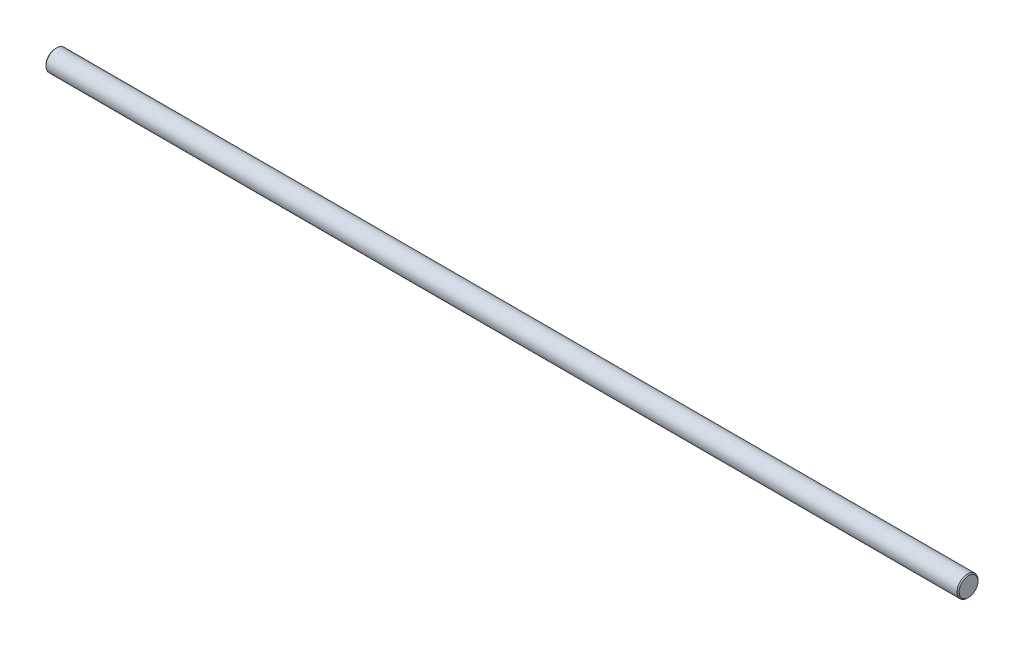
ISO-10303-21;
HEADER;
FILE_DESCRIPTION(('STEP AP214'),'2;1');
FILE_NAME('part.step','',(''),(''),'','','');
FILE_SCHEMA(('AUTOMOTIVE_DESIGN { 1 0 10303 214 1 1 1 1 }'));
ENDSEC;
DATA;
#1=APPLICATION_CONTEXT('core data for automotive mechanical design processes');
#2=APPLICATION_PROTOCOL_DEFINITION('international standard','automotive_design',2000,#1);
#3=PRODUCT_CONTEXT('',#1,'mechanical');
#4=PRODUCT('Part','Part','',(#3));
#5=PRODUCT_RELATED_PRODUCT_CATEGORY('part','',(#4));
#6=PRODUCT_DEFINITION_FORMATION('','',#4);
#7=PRODUCT_DEFINITION_CONTEXT('part definition',#1,'design');
#8=PRODUCT_DEFINITION('design','',#6,#7);
#9=PRODUCT_DEFINITION_SHAPE('','',#8);
#10=(LENGTH_UNIT() NAMED_UNIT(*) SI_UNIT(.MILLI.,.METRE.));
#11=(NAMED_UNIT(*) PLANE_ANGLE_UNIT() SI_UNIT($,.RADIAN.));
#12=(NAMED_UNIT(*) SI_UNIT($,.STERADIAN.) SOLID_ANGLE_UNIT());
#13=UNCERTAINTY_MEASURE_WITH_UNIT(LENGTH_MEASURE(1.E-05),#10,'distance_accuracy_value','');
#14=(GEOMETRIC_REPRESENTATION_CONTEXT(3) GLOBAL_UNCERTAINTY_ASSIGNED_CONTEXT((#13)) GLOBAL_UNIT_ASSIGNED_CONTEXT((#10,
#11,#12)) REPRESENTATION_CONTEXT('',''));
#15=CARTESIAN_POINT('',(0.,0.,0.));
#16=DIRECTION('',(0.,0.,1.));
#17=DIRECTION('',(1.,0.,0.));
#18=AXIS2_PLACEMENT_3D('',#15,#16,#17);
#19=CARTESIAN_POINT('',(0.,0.,0.));
#20=DIRECTION('',(1.,0.,0.));
#21=DIRECTION('',(0.,1.,0.));
#22=AXIS2_PLACEMENT_3D('',#19,#20,#21);
#23=PLANE('',#22);
#24=CARTESIAN_POINT('',(0.,0.,0.));
#25=DIRECTION('',(-1.,0.,0.));
#26=DIRECTION('',(0.,-1.,0.));
#27=AXIS2_PLACEMENT_3D('',#24,#25,#26);
#28=CIRCLE('',#27,4.5);
#29=CARTESIAN_POINT('',(0.,-4.5,0.));
#30=VERTEX_POINT('',#29);
#31=EDGE_CURVE('E10',#30,#30,#28,.T.);
#32=ORIENTED_EDGE('',*,*,#31,.T.);
#33=EDGE_LOOP('',(#32));
#34=FACE_BOUND('',#33,.T.);
#35=ADVANCED_FACE('F31',(#34),#23,.F.);
#36=CARTESIAN_POINT('',(0.5,0.,0.));
#37=DIRECTION('',(1.,0.,0.));
#38=DIRECTION('',(0.,1.,0.));
#39=AXIS2_PLACEMENT_3D('',#36,#37,#38);
#40=CONICAL_SURFACE('',#39,5.,0.785398163397448);
#41=ORIENTED_EDGE('',*,*,#31,.F.);
#42=EDGE_LOOP('',(#41));
#43=FACE_BOUND('',#42,.T.);
#44=CARTESIAN_POINT('',(0.5,0.,0.));
#45=DIRECTION('',(-1.,0.,0.));
#46=DIRECTION('',(0.,-1.,0.));
#47=AXIS2_PLACEMENT_3D('',#44,#45,#46);
#48=CIRCLE('',#47,5.);
#49=CARTESIAN_POINT('',(0.500000000000001,-5.,0.));
#50=VERTEX_POINT('',#49);
#51=EDGE_CURVE('E37',#50,#50,#48,.T.);
#52=ORIENTED_EDGE('',*,*,#51,.T.);
#53=EDGE_LOOP('',(#52));
#54=FACE_BOUND('',#53,.T.);
#55=ADVANCED_FACE('F63',(#43,#54),#40,.T.);
#56=CARTESIAN_POINT('',(435.,0.,0.));
#57=DIRECTION('',(-1.,0.,0.));
#58=DIRECTION('',(0.,-1.,0.));
#59=AXIS2_PLACEMENT_3D('',#56,#57,#58);
#60=CYLINDRICAL_SURFACE('',#59,4.99999999999997);
#61=ORIENTED_EDGE('',*,*,#51,.F.);
#62=EDGE_LOOP('',(#61));
#63=FACE_BOUND('',#62,.T.);
#64=CARTESIAN_POINT('',(434.5,0.,0.));
#65=DIRECTION('',(-1.,0.,0.));
#66=DIRECTION('',(0.,-1.,0.));
#67=AXIS2_PLACEMENT_3D('',#64,#65,#66);
#68=CIRCLE('',#67,4.99999999999995);
#69=CARTESIAN_POINT('',(434.5,-4.99999999999994,0.));
#70=VERTEX_POINT('',#69);
#71=EDGE_CURVE('E41',#70,#70,#68,.T.);
#72=ORIENTED_EDGE('',*,*,#71,.T.);
#73=EDGE_LOOP('',(#72));
#74=FACE_BOUND('',#73,.T.);
#75=ADVANCED_FACE('F59',(#63,#74),#60,.T.);
#76=CARTESIAN_POINT('',(435.,0.,0.));
#77=DIRECTION('',(-1.,0.,0.));
#78=DIRECTION('',(0.,-1.,0.));
#79=AXIS2_PLACEMENT_3D('',#76,#77,#78);
#80=CONICAL_SURFACE('',#79,4.5,0.785398163397395);
#81=ORIENTED_EDGE('',*,*,#71,.F.);
#82=EDGE_LOOP('',(#81));
#83=FACE_BOUND('',#82,.T.);
#84=CARTESIAN_POINT('',(435.,0.,0.));
#85=DIRECTION('',(-1.,0.,0.));
#86=DIRECTION('',(0.,-1.,0.));
#87=AXIS2_PLACEMENT_3D('',#84,#85,#86);
#88=CIRCLE('',#87,4.5);
#89=CARTESIAN_POINT('',(435.,-4.49999999999999,0.));
#90=VERTEX_POINT('',#89);
#91=EDGE_CURVE('E45',#90,#90,#88,.T.);
#92=ORIENTED_EDGE('',*,*,#91,.T.);
#93=EDGE_LOOP('',(#92));
#94=FACE_BOUND('',#93,.T.);
#95=ADVANCED_FACE('F51',(#83,#94),#80,.T.);
#96=CARTESIAN_POINT('',(435.,4.50000000000001,0.));
#97=DIRECTION('',(-1.,0.,0.));
#98=DIRECTION('',(0.,-1.,0.));
#99=AXIS2_PLACEMENT_3D('',#96,#97,#98);
#100=PLANE('',#99);
#101=ORIENTED_EDGE('',*,*,#91,.F.);
#102=EDGE_LOOP('',(#101));
#103=FACE_BOUND('',#102,.T.);
#104=ADVANCED_FACE('F53',(#103),#100,.F.);
#105=CLOSED_SHELL('',(#35,#55,#75,#95,#104));
#106=MANIFOLD_SOLID_BREP('B2',#105);
#107=ADVANCED_BREP_SHAPE_REPRESENTATION('',(#18,#106),#14);
#108=SHAPE_DEFINITION_REPRESENTATION(#9,#107);
ENDSEC;
END-ISO-10303-21;
